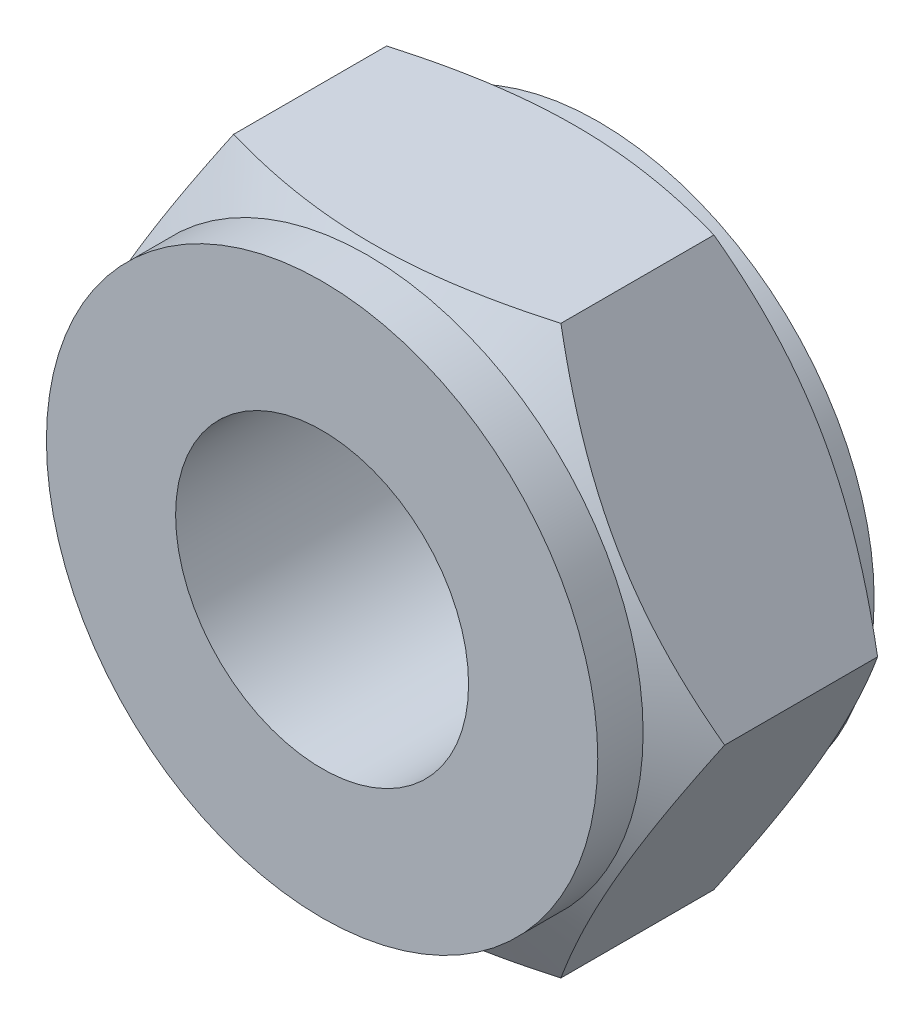
ISO-10303-21;
HEADER;
FILE_DESCRIPTION(('STEP AP214'),'2;1');
FILE_NAME('part.step','',(''),(''),'','','');
FILE_SCHEMA(('AUTOMOTIVE_DESIGN { 1 0 10303 214 1 1 1 1 }'));
ENDSEC;
DATA;
#1=APPLICATION_CONTEXT('core data for automotive mechanical design processes');
#2=APPLICATION_PROTOCOL_DEFINITION('international standard','automotive_design',2000,#1);
#3=PRODUCT_CONTEXT('',#1,'mechanical');
#4=PRODUCT('Part','Part','',(#3));
#5=PRODUCT_RELATED_PRODUCT_CATEGORY('part','',(#4));
#6=PRODUCT_DEFINITION_FORMATION('','',#4);
#7=PRODUCT_DEFINITION_CONTEXT('part definition',#1,'design');
#8=PRODUCT_DEFINITION('design','',#6,#7);
#9=PRODUCT_DEFINITION_SHAPE('','',#8);
#10=(LENGTH_UNIT() NAMED_UNIT(*) SI_UNIT(.MILLI.,.METRE.));
#11=(NAMED_UNIT(*) PLANE_ANGLE_UNIT() SI_UNIT($,.RADIAN.));
#12=(NAMED_UNIT(*) SI_UNIT($,.STERADIAN.) SOLID_ANGLE_UNIT());
#13=UNCERTAINTY_MEASURE_WITH_UNIT(LENGTH_MEASURE(1.E-05),#10,'distance_accuracy_value','');
#14=(GEOMETRIC_REPRESENTATION_CONTEXT(3) GLOBAL_UNCERTAINTY_ASSIGNED_CONTEXT((#13)) GLOBAL_UNIT_ASSIGNED_CONTEXT((#10,
#11,#12)) REPRESENTATION_CONTEXT('',''));
#15=CARTESIAN_POINT('',(0.,0.,0.));
#16=DIRECTION('',(0.,0.,1.));
#17=DIRECTION('',(1.,0.,0.));
#18=AXIS2_PLACEMENT_3D('',#15,#16,#17);
#19=CARTESIAN_POINT('',(0.,0.,3.28));
#20=DIRECTION('',(0.,0.,-1.));
#21=DIRECTION('',(-1.,0.,0.));
#22=AXIS2_PLACEMENT_3D('',#19,#20,#21);
#23=CYLINDRICAL_SURFACE('',#22,3.89);
#24=CARTESIAN_POINT('',(0.,0.,-3.52));
#25=DIRECTION('',(0.,0.,-1.));
#26=DIRECTION('',(-1.,0.,0.));
#27=AXIS2_PLACEMENT_3D('',#24,#25,#26);
#28=CIRCLE('',#27,3.89);
#29=CARTESIAN_POINT('',(-3.89,0.,-3.52));
#30=VERTEX_POINT('',#29);
#31=EDGE_CURVE('E20',#30,#30,#28,.T.);
#32=ORIENTED_EDGE('',*,*,#31,.F.);
#33=EDGE_LOOP('',(#32));
#34=FACE_BOUND('',#33,.T.);
#35=CARTESIAN_POINT('',(0.,0.,-3.26019237883202));
#36=DIRECTION('',(0.,0.,1.));
#37=DIRECTION('',(-1.,0.,0.));
#38=AXIS2_PLACEMENT_3D('',#35,#36,#37);
#39=CIRCLE('',#38,3.89000000006945);
#40=CARTESIAN_POINT('',(-3.89000000006945,0.,-3.26019237883202));
#41=VERTEX_POINT('',#40);
#42=EDGE_CURVE('E189',#41,#41,#39,.T.);
#43=ORIENTED_EDGE('',*,*,#42,.F.);
#44=EDGE_LOOP('',(#43));
#45=FACE_BOUND('',#44,.T.);
#46=ADVANCED_FACE('F17',(#34,#45),#23,.T.);
#47=CARTESIAN_POINT('',(0.,0.,-2.83689361464212));
#48=DIRECTION('',(0.,0.,1.));
#49=DIRECTION('',(1.,0.,0.));
#50=AXIS2_PLACEMENT_3D('',#47,#48,#49);
#51=CONICAL_SURFACE('',#50,4.62317496641163,1.04719755119624);
#52=CARTESIAN_POINT('',(-4.61880215351368,-5.73590683433179E-12,-2.83941825934587));
#53=CARTESIAN_POINT('',(-4.51731796242767,-0.175775775131739,-2.89802716909246));
#54=CARTESIAN_POINT('',(-4.41495776124794,-0.353068844247999,-2.95132890514521));
#55=CARTESIAN_POINT('',(-4.20846506047572,-0.710724693377609,-3.04436548454486));
#56=CARTESIAN_POINT('',(-4.10432889310188,-0.891093826174593,-3.08406741866906));
#57=CARTESIAN_POINT('',(-3.89734706567413,-1.24959686752292,-3.14586634145278));
#58=CARTESIAN_POINT('',(-3.79453324350631,-1.42767563123793,-3.16837468415098));
#59=CARTESIAN_POINT('',(-3.5884220785619,-1.78467064092886,-3.19523992308358));
#60=CARTESIAN_POINT('',(-3.4851254844293,-1.96358559021534,-3.1996190713959));
#61=CARTESIAN_POINT('',(-3.29212687968423,-2.29786897942371,-3.19048567903444));
#62=CARTESIAN_POINT('',(-3.2023959080588,-2.45328758129148,-3.1792156889114));
#63=CARTESIAN_POINT('',(-3.02351853281839,-2.76311228353242,-3.14350365790747));
#64=CARTESIAN_POINT('',(-2.93437274743071,-2.91751731310451,-3.11904942980642));
#65=CARTESIAN_POINT('',(-2.75512686792788,-3.22798028345079,-3.05791859266708));
#66=CARTESIAN_POINT('',(-2.66504944835346,-3.38399895076839,-3.02098297490716));
#67=CARTESIAN_POINT('',(-2.48623772534369,-3.69370994001023,-2.93715473766519));
#68=CARTESIAN_POINT('',(-2.39750113289062,-3.84740622662948,-2.89028180183956));
#69=CARTESIAN_POINT('',(-2.30940107675872,-3.99999999999961,-2.83941825934408));
#70=B_SPLINE_CURVE_WITH_KNOTS('',3,(#52,#53,#54,#55,#56,#57,#58,#59,#60,#61,#62,#63,#64,#65,#66,
#67,#68,#69),.UNSPECIFIED.,.F.,.F.,(4,2,2,2,2,2,2,2,4),(0.,0.634032023113349,1.26958763405349,
1.88941521230476,2.5084817777942,3.04741556526093,3.58684838758453,4.13824324497157,
4.68855594702268),.UNSPECIFIED.);
#71=CARTESIAN_POINT('',(-4.6188021534735,0.,-2.83941825937969));
#72=VERTEX_POINT('',#71);
#73=CARTESIAN_POINT('',(-2.30940107675838,-3.99999999999981,-2.83941825934408));
#74=VERTEX_POINT('',#73);
#75=EDGE_CURVE('E63',#72,#74,#70,.T.);
#76=ORIENTED_EDGE('',*,*,#75,.F.);
#77=CARTESIAN_POINT('',(-2.30940107675872,3.99999999999961,-2.83941825934408));
#78=CARTESIAN_POINT('',(-2.41088526784479,3.82422422487352,-2.89802716909082));
#79=CARTESIAN_POINT('',(-2.51324546902457,3.64693115575717,-2.95132890514373));
#80=CARTESIAN_POINT('',(-2.7197381697969,3.28927530662738,-3.0443654845437));
#81=CARTESIAN_POINT('',(-2.82387433717079,3.1089061738303,-3.08406741866806));
#82=CARTESIAN_POINT('',(-3.03085616459866,2.75040313248178,-3.14586634145211));
#83=CARTESIAN_POINT('',(-3.13366998676653,2.57232436876667,-3.16837468415047));
#84=CARTESIAN_POINT('',(-3.33978115171107,2.21532935907552,-3.19523992308339));
#85=CARTESIAN_POINT('',(-3.44307774584373,2.03641440978893,-3.19961907139588));
#86=CARTESIAN_POINT('',(-3.6360763505888,1.70213102058056,-3.19048567903468));
#87=CARTESIAN_POINT('',(-3.72580732221417,1.5467124187129,-3.17921568891178));
#88=CARTESIAN_POINT('',(-3.90468469745445,1.23688771647217,-3.14350365790813));
#89=CARTESIAN_POINT('',(-3.99383048284208,1.08248268690018,-3.11904942980722));
#90=CARTESIAN_POINT('',(-4.1730763623448,0.772019716554091,-3.05791859266816));
#91=CARTESIAN_POINT('',(-4.26315378191916,0.616001049236596,-3.02098297490839));
#92=CARTESIAN_POINT('',(-4.44196550492881,0.306290059994944,-2.9371547376667));
#93=CARTESIAN_POINT('',(-4.53070209738183,0.152593773375783,-2.89028180184121));
#94=CARTESIAN_POINT('',(-4.61880215351369,5.74348867595268E-12,-2.83941825934587));
#95=B_SPLINE_CURVE_WITH_KNOTS('',3,(#77,#78,#79,#80,#81,#82,#83,#84,#85,#86,#87,#88,#89,#90,#91,
#92,#93,#94),.UNSPECIFIED.,.F.,.F.,(4,2,2,2,2,2,2,2,4),(0.,0.63403202311376,1.26958763405432,
1.88941521230599,2.50848177779582,3.04741556526215,3.58684838758535,4.13824324497197,
4.68855594702266),.UNSPECIFIED.);
#96=CARTESIAN_POINT('',(-2.30940107675839,3.99999999999981,-2.83941825934408));
#97=VERTEX_POINT('',#96);
#98=EDGE_CURVE('E68',#97,#72,#95,.T.);
#99=ORIENTED_EDGE('',*,*,#98,.F.);
#100=CARTESIAN_POINT('',(2.30940107675805,4.,-2.83941825934408));
#101=CARTESIAN_POINT('',(2.10643269458592,4.,-2.89802716909082));
#102=CARTESIAN_POINT('',(1.90171229222636,4.,-2.95132890514373));
#103=CARTESIAN_POINT('',(1.48872689068169,4.,-3.0443654845437));
#104=CARTESIAN_POINT('',(1.2804545559339,4.,-3.08406741866807));
#105=CARTESIAN_POINT('',(0.866490901078168,4.,-3.14586634145211));
#106=CARTESIAN_POINT('',(0.660863256742426,4.,-3.16837468415047));
#107=CARTESIAN_POINT('',(0.248640926853356,4.,-3.19523992308339));
#108=CARTESIAN_POINT('',(0.0420477385880334,4.,-3.19961907139587));
#109=CARTESIAN_POINT('',(-0.343949470902628,4.,-3.19048567903466));
#110=CARTESIAN_POINT('',(-0.523411414153886,4.,-3.17921568891171));
#111=CARTESIAN_POINT('',(-0.881166164635488,4.,-3.14350365790788));
#112=CARTESIAN_POINT('',(-1.05945773541124,4.,-3.11904942980684));
#113=CARTESIAN_POINT('',(-1.41794949441772,4.,-3.05791859266747));
#114=CARTESIAN_POINT('',(-1.59810433356697,4.,-3.02098297490751));
#115=CARTESIAN_POINT('',(-1.95572777958731,4.,-2.93715473766539));
#116=CARTESIAN_POINT('',(-2.13320096449385,4.,-2.89028180183967));
#117=CARTESIAN_POINT('',(-2.30940107675805,4.,-2.83941825934408));
#118=B_SPLINE_CURVE_WITH_KNOTS('',3,(#100,#101,#102,#103,#104,#105,#106,#107,#108,#109,#110,
#111,#112,#113,#114,#115,#116,#117),.UNSPECIFIED.,.F.,.F.,(4,2,2,2,2,2,2,2,4),(0.,
0.634032023113766,1.26958763405433,1.88941521230599,2.50848177779582,3.04741556526371,
3.58684838758848,4.13824324497675,4.68855594702908),.UNSPECIFIED.);
#119=CARTESIAN_POINT('',(2.30940107675839,3.99999999999981,-2.83941825934408));
#120=VERTEX_POINT('',#119);
#121=EDGE_CURVE('E80',#120,#97,#118,.T.);
#122=ORIENTED_EDGE('',*,*,#121,.F.);
#123=CARTESIAN_POINT('',(4.61880215351369,5.73604323312061E-12,-2.83941825934586));
#124=CARTESIAN_POINT('',(4.51731796242768,0.17577577513174,-2.89802716909245));
#125=CARTESIAN_POINT('',(4.41495776124795,0.353068844248001,-2.95132890514521));
#126=CARTESIAN_POINT('',(4.20846506047573,0.710724693377611,-3.04436548454486));
#127=CARTESIAN_POINT('',(4.10432889310189,0.891093826174595,-3.08406741866906));
#128=CARTESIAN_POINT('',(3.89734706567413,1.24959686752292,-3.14586634145277));
#129=CARTESIAN_POINT('',(3.79453324350632,1.42767563123793,-3.16837468415097));
#130=CARTESIAN_POINT('',(3.5884220785619,1.78467064092887,-3.19523992308357));
#131=CARTESIAN_POINT('',(3.4851254844293,1.96358559021535,-3.1996190713959));
#132=CARTESIAN_POINT('',(3.29212687968424,2.29786897942371,-3.19048567903443));
#133=CARTESIAN_POINT('',(3.2023959080588,2.45328758129148,-3.1792156889114));
#134=CARTESIAN_POINT('',(3.0235185328184,2.76311228353242,-3.14350365790747));
#135=CARTESIAN_POINT('',(2.93437274743072,2.91751731310451,-3.11904942980641));
#136=CARTESIAN_POINT('',(2.75512686792788,3.2279802834508,-3.05791859266707));
#137=CARTESIAN_POINT('',(2.66504944835347,3.38399895076839,-3.02098297490715));
#138=CARTESIAN_POINT('',(2.4862377253437,3.69370994001023,-2.93715473766518));
#139=CARTESIAN_POINT('',(2.39750113289063,3.84740622662948,-2.89028180183956));
#140=CARTESIAN_POINT('',(2.30940107675873,3.99999999999961,-2.83941825934408));
#141=B_SPLINE_CURVE_WITH_KNOTS('',3,(#123,#124,#125,#126,#127,#128,#129,#130,#131,#132,#133,
#134,#135,#136,#137,#138,#139,#140),.UNSPECIFIED.,.F.,.F.,(4,2,2,2,2,2,2,2,4),(0.,
0.63403202311335,1.26958763405349,1.88941521230476,2.50848177779421,3.04741556526093,
3.58684838758453,4.13824324497157,4.68855594702267),.UNSPECIFIED.);
#142=CARTESIAN_POINT('',(4.61880215348771,0.,-2.83941825935585));
#143=VERTEX_POINT('',#142);
#144=EDGE_CURVE('E198',#143,#120,#141,.T.);
#145=ORIENTED_EDGE('',*,*,#144,.F.);
#146=CARTESIAN_POINT('',(2.30940107675874,-3.99999999999961,-2.83941825934408));
#147=CARTESIAN_POINT('',(2.4108852678448,-3.82422422487352,-2.89802716909081));
#148=CARTESIAN_POINT('',(2.51324546902458,-3.64693115575717,-2.95132890514372));
#149=CARTESIAN_POINT('',(2.71973816979691,-3.28927530662738,-3.04436548454369));
#150=CARTESIAN_POINT('',(2.82387433717081,-3.1089061738303,-3.08406741866806));
#151=CARTESIAN_POINT('',(3.03085616459868,-2.75040313248177,-3.1458663414521));
#152=CARTESIAN_POINT('',(3.13366998676655,-2.57232436876667,-3.16837468415047));
#153=CARTESIAN_POINT('',(3.33978115171109,-2.21532935907552,-3.19523992308339));
#154=CARTESIAN_POINT('',(3.44307774584375,-2.03641440978893,-3.19961907139587));
#155=CARTESIAN_POINT('',(3.63607635058882,-1.70213102058056,-3.19048567903467));
#156=CARTESIAN_POINT('',(3.72580732221419,-1.5467124187129,-3.17921568891177));
#157=CARTESIAN_POINT('',(3.90468469745447,-1.23688771647216,-3.14350365790812));
#158=CARTESIAN_POINT('',(3.99383048284209,-1.08248268690017,-3.11904942980721));
#159=CARTESIAN_POINT('',(4.17307636234482,-0.772019716554091,-3.05791859266815));
#160=CARTESIAN_POINT('',(4.26315378191918,-0.616001049236597,-3.02098297490838));
#161=CARTESIAN_POINT('',(4.44196550492883,-0.306290059994946,-2.93715473766669));
#162=CARTESIAN_POINT('',(4.53070209738185,-0.152593773375787,-2.8902818018412));
#163=CARTESIAN_POINT('',(4.6188021535137,-5.74804397884381E-12,-2.83941825934586));
#164=B_SPLINE_CURVE_WITH_KNOTS('',3,(#146,#147,#148,#149,#150,#151,#152,#153,#154,#155,#156,
#157,#158,#159,#160,#161,#162,#163),.UNSPECIFIED.,.F.,.F.,(4,2,2,2,2,2,2,2,4),(0.,
0.634032023113761,1.26958763405432,1.88941521230599,2.50848177779583,3.04741556526215,
3.58684838758535,4.13824324497196,4.68855594702265),.UNSPECIFIED.);
#165=CARTESIAN_POINT('',(2.3094010767584,-3.9999999999998,-2.83941825934408));
#166=VERTEX_POINT('',#165);
#167=EDGE_CURVE('E113',#166,#143,#164,.T.);
#168=ORIENTED_EDGE('',*,*,#167,.F.);
#169=CARTESIAN_POINT('',(-2.30940107675804,-4.,-2.83941825934408));
#170=CARTESIAN_POINT('',(-2.10643269458591,-4.,-2.89802716909082));
#171=CARTESIAN_POINT('',(-1.90171229222635,-4.,-2.95132890514373));
#172=CARTESIAN_POINT('',(-1.48872689068169,-4.,-3.0443654845437));
#173=CARTESIAN_POINT('',(-1.2804545559339,-4.,-3.08406741866807));
#174=CARTESIAN_POINT('',(-0.866490901078162,-4.,-3.14586634145211));
#175=CARTESIAN_POINT('',(-0.66086325674242,-4.,-3.16837468415047));
#176=CARTESIAN_POINT('',(-0.24864092685335,-4.,-3.19523992308339));
#177=CARTESIAN_POINT('',(-0.0420477385880274,-4.,-3.19961907139588));
#178=CARTESIAN_POINT('',(0.343949470902635,-4.,-3.19048567903466));
#179=CARTESIAN_POINT('',(0.523411414153894,-4.,-3.17921568891171));
#180=CARTESIAN_POINT('',(0.881166164635497,-4.,-3.14350365790788));
#181=CARTESIAN_POINT('',(1.05945773541125,-4.,-3.11904942980684));
#182=CARTESIAN_POINT('',(1.41794949441773,-4.,-3.05791859266747));
#183=CARTESIAN_POINT('',(1.59810433356698,-4.,-3.02098297490751));
#184=CARTESIAN_POINT('',(1.95572777958732,-4.,-2.93715473766539));
#185=CARTESIAN_POINT('',(2.13320096449386,-4.,-2.89028180183967));
#186=CARTESIAN_POINT('',(2.30940107675806,-4.,-2.83941825934408));
#187=B_SPLINE_CURVE_WITH_KNOTS('',3,(#169,#170,#171,#172,#173,#174,#175,#176,#177,#178,#179,
#180,#181,#182,#183,#184,#185,#186),.UNSPECIFIED.,.F.,.F.,(4,2,2,2,2,2,2,2,4),(0.,
0.634032023113765,1.26958763405433,1.88941521230599,2.50848177779582,3.04741556526371,
3.58684838758848,4.13824324497675,4.68855594702909),.UNSPECIFIED.);
#188=EDGE_CURVE('E71',#74,#166,#187,.T.);
#189=ORIENTED_EDGE('',*,*,#188,.F.);
#190=EDGE_LOOP('',(#76,#99,#122,#145,#168,#189));
#191=FACE_BOUND('',#190,.T.);
#192=ORIENTED_EDGE('',*,*,#42,.T.);
#193=EDGE_LOOP('',(#192));
#194=FACE_BOUND('',#193,.T.);
#195=ADVANCED_FACE('F64',(#191,#194),#51,.T.);
#196=CARTESIAN_POINT('',(-2.30940107675849,-4.,-3.52));
#197=DIRECTION('',(0.,0.,-1.));
#198=DIRECTION('',(-1.,0.,0.));
#199=AXIS2_PLACEMENT_3D('',#196,#197,#198);
#200=PLANE('',#199);
#201=CARTESIAN_POINT('',(0.,0.,-3.52000000004606));
#202=DIRECTION('',(0.,0.,-1.));
#203=DIRECTION('',(-1.,0.,0.));
#204=AXIS2_PLACEMENT_3D('',#201,#202,#203);
#205=CIRCLE('',#204,2.87500000001728);
#206=CARTESIAN_POINT('',(-2.87500000001728,0.,-3.52000000004606));
#207=VERTEX_POINT('',#206);
#208=EDGE_CURVE('E83',#207,#207,#205,.F.);
#209=ORIENTED_EDGE('',*,*,#208,.T.);
#210=EDGE_LOOP('',(#209));
#211=FACE_BOUND('',#210,.T.);
#212=ORIENTED_EDGE('',*,*,#31,.T.);
#213=EDGE_LOOP('',(#212));
#214=FACE_BOUND('',#213,.T.);
#215=ADVANCED_FACE('F106',(#211,#214),#200,.T.);
#216=CARTESIAN_POINT('',(-4.618802153517,0.,-3.52));
#217=DIRECTION('',(-0.866025403784439,-0.5,0.));
#218=DIRECTION('',(0.5,-0.866025403784439,0.));
#219=AXIS2_PLACEMENT_3D('',#216,#217,#218);
#220=PLANE('',#219);
#221=DIRECTION('',(0.,0.,1.));
#222=VECTOR('',#221,1.);
#223=CARTESIAN_POINT('',(-4.618802153517,0.,-3.52));
#224=LINE('',#223,#222);
#225=CARTESIAN_POINT('',(-4.61880215351613,0.,-0.680581740657889));
#226=VERTEX_POINT('',#225);
#227=EDGE_CURVE('E74',#72,#226,#224,.T.);
#228=ORIENTED_EDGE('',*,*,#227,.F.);
#229=ORIENTED_EDGE('',*,*,#75,.T.);
#230=DIRECTION('',(0.,0.,1.));
#231=VECTOR('',#230,1.);
#232=CARTESIAN_POINT('',(-2.30940107675849,-4.,-3.52));
#233=LINE('',#232,#231);
#234=CARTESIAN_POINT('',(-2.30940109340961,-4.,-0.680581745467265));
#235=VERTEX_POINT('',#234);
#236=EDGE_CURVE('E73',#235,#74,#233,.F.);
#237=ORIENTED_EDGE('',*,*,#236,.F.);
#238=CARTESIAN_POINT('',(-4.61880215351596,-1.80305391824773E-12,-0.680581740659897));
#239=CARTESIAN_POINT('',(-4.51731796244398,-0.175775775103493,-0.621972830921223));
#240=CARTESIAN_POINT('',(-4.41495776127846,-0.353068844195138,-0.568671094875031));
#241=CARTESIAN_POINT('',(-4.20846506053689,-0.710724693271661,-0.475634515485113));
#242=CARTESIAN_POINT('',(-4.10432889317952,-0.891093826040126,-0.435932581363831));
#243=CARTESIAN_POINT('',(-3.89734706575416,-1.24959686738429,-0.374133658570449));
#244=CARTESIAN_POINT('',(-3.7945332435719,-1.42767563112431,-0.351625315864611));
#245=CARTESIAN_POINT('',(-3.58842207859598,-1.78467064086982,-0.324760076922744));
#246=CARTESIAN_POINT('',(-3.48512548444632,-1.96358559018586,-0.320380928609024));
#247=CARTESIAN_POINT('',(-3.29212688334392,-2.29786897308494,-0.329514320795707));
#248=CARTESIAN_POINT('',(-3.20239591537037,-2.45328756862745,-0.340784310171359));
#249=CARTESIAN_POINT('',(-3.02351854737306,-2.763112258323,-0.376496338652439));
#250=CARTESIAN_POINT('',(-2.93437276557644,-2.9175172816752,-0.400950564975588));
#251=CARTESIAN_POINT('',(-2.75512689333883,-3.22798023943772,-0.462081397681879));
#252=CARTESIAN_POINT('',(-2.66504947743503,-3.38399890039763,-0.49901701275454));
#253=CARTESIAN_POINT('',(-2.48623776163293,-3.69370987715542,-0.582845244037596));
#254=CARTESIAN_POINT('',(-2.3975011727174,-3.84740615764747,-0.629718176595119));
#255=CARTESIAN_POINT('',(-2.30940112007343,-3.99999992497632,-0.680581715652609));
#256=B_SPLINE_CURVE_WITH_KNOTS('',3,(#238,#239,#240,#241,#242,#243,#244,#245,#246,#247,#248,
#249,#250,#251,#252,#253,#254,#255),.UNSPECIFIED.,.F.,.F.,(4,2,2,2,2,2,2,2,4),(0.,
0.634032023026007,1.26958763386756,1.88941521220828,2.50848177779535,3.04741554331967,
3.58684834361968,4.13824317783946,4.68855585689971),.UNSPECIFIED.);
#257=EDGE_CURVE('E35',#226,#235,#256,.T.);
#258=ORIENTED_EDGE('',*,*,#257,.F.);
#259=EDGE_LOOP('',(#228,#229,#237,#258));
#260=FACE_BOUND('',#259,.T.);
#261=ADVANCED_FACE('F75',(#260),#220,.T.);
#262=CARTESIAN_POINT('',(-2.30940107675849,-4.,-3.52));
#263=DIRECTION('',(0.,-1.,0.));
#264=DIRECTION('',(1.,0.,0.));
#265=AXIS2_PLACEMENT_3D('',#262,#263,#264);
#266=PLANE('',#265);
#267=ORIENTED_EDGE('',*,*,#236,.T.);
#268=ORIENTED_EDGE('',*,*,#188,.T.);
#269=DIRECTION('',(0.,0.,1.));
#270=VECTOR('',#269,1.);
#271=CARTESIAN_POINT('',(2.30940107675852,-4.,-3.52));
#272=LINE('',#271,#270);
#273=CARTESIAN_POINT('',(2.30940106843087,-4.00000001442391,-0.680581745468477));
#274=VERTEX_POINT('',#273);
#275=EDGE_CURVE('E130',#274,#166,#272,.F.);
#276=ORIENTED_EDGE('',*,*,#275,.F.);
#277=CARTESIAN_POINT('',(-2.30940110351642,-3.99999996248763,-0.680581772944216));
#278=CARTESIAN_POINT('',(-2.10643272249927,-3.99999998652724,-0.621972847174614));
#279=CARTESIAN_POINT('',(-1.90171231902133,-3.99999999638907,-0.568671103799689));
#280=CARTESIAN_POINT('',(-1.48872691340506,-4.0000000036196,-0.475634517672028));
#281=CARTESIAN_POINT('',(-1.28045457570248,-4.00000000095822,-0.43593258414569));
#282=CARTESIAN_POINT('',(-0.866490915803741,-3.99999999906549,-0.374133660889823));
#283=CARTESIAN_POINT('',(-0.660863269373307,-3.99999999975089,-0.351625317135899));
#284=CARTESIAN_POINT('',(-0.248640935005505,-4.0000000002488,-0.324760076994751));
#285=CARTESIAN_POINT('',(-0.042047744355798,-4.00000000006239,-0.320380928537159));
#286=CARTESIAN_POINT('',(0.343949460368308,-3.99999999994568,-0.329514320663676));
#287=CARTESIAN_POINT('',(0.523411396493218,-3.99999999998536,-0.340784309946792));
#288=CARTESIAN_POINT('',(0.881166132795949,-4.00000000001465,-0.376496338300437));
#289=CARTESIAN_POINT('',(1.05945769651991,-4.00000000000422,-0.400950564584484));
#290=CARTESIAN_POINT('',(1.41794944151398,-3.99999999999568,-0.462081397272556));
#291=CARTESIAN_POINT('',(1.59810427370667,-3.99999999999784,-0.499017012383614));
#292=CARTESIAN_POINT('',(1.95572770615214,-4.00000000000215,-0.582845243809378));
#293=CARTESIAN_POINT('',(2.13320088443837,-4.0000000000043,-0.629718176475666));
#294=CARTESIAN_POINT('',(2.30940099017536,-4.,-0.680581715666101));
#295=B_SPLINE_CURVE_WITH_KNOTS('',3,(#277,#278,#279,#280,#281,#282,#283,#284,#285,#286,#287,
#288,#289,#290,#291,#292,#293,#294),.UNSPECIFIED.,.F.,.F.,(4,2,2,2,2,2,2,2,4),(0.,
0.634032031834983,1.26958765081319,1.88941523582196,2.50848180835725,3.0474155744189,
3.58684837508235,4.13824321045645,4.68855589091895),.UNSPECIFIED.);
#296=EDGE_CURVE('E141',#235,#274,#295,.T.);
#297=ORIENTED_EDGE('',*,*,#296,.F.);
#298=EDGE_LOOP('',(#267,#268,#276,#297));
#299=FACE_BOUND('',#298,.T.);
#300=ADVANCED_FACE('F131',(#299),#266,.T.);
#301=CARTESIAN_POINT('',(2.30940107675852,-4.,-3.52));
#302=DIRECTION('',(0.866025403784439,-0.5,0.));
#303=DIRECTION('',(0.5,0.866025403784439,0.));
#304=AXIS2_PLACEMENT_3D('',#301,#302,#303);
#305=PLANE('',#304);
#306=ORIENTED_EDGE('',*,*,#275,.T.);
#307=ORIENTED_EDGE('',*,*,#167,.T.);
#308=DIRECTION('',(0.,0.,1.));
#309=VECTOR('',#308,1.);
#310=CARTESIAN_POINT('',(4.61880215351701,0.,-3.52));
#311=LINE('',#310,#309);
#312=CARTESIAN_POINT('',(4.61880215351597,0.,-0.680581740659905));
#313=VERTEX_POINT('',#312);
#314=EDGE_CURVE('E195',#313,#143,#311,.F.);
#315=ORIENTED_EDGE('',*,*,#314,.F.);
#316=CARTESIAN_POINT('',(2.30940103090809,-4.00000000444028,-0.680581772931595));
#317=CARTESIAN_POINT('',(2.41088524223646,-3.82422424230081,-0.621972847163885));
#318=CARTESIAN_POINT('',(2.51324545252448,-3.64693117711912,-0.568671103786385));
#319=CARTESIAN_POINT('',(2.71973816162016,-3.28927532802434,-0.475634517651644));
#320=CARTESIAN_POINT('',(2.82387432818394,-3.10890619131118,-0.435932584121048));
#321=CARTESIAN_POINT('',(3.03085615649661,-2.75040314464718,-0.374133660873277));
#322=CARTESIAN_POINT('',(3.1336699802902,-2.57232437948613,-0.35162531712675));
#323=CARTESIAN_POINT('',(3.33978114787275,-2.21532936622099,-0.324760076993857));
#324=CARTESIAN_POINT('',(3.44307774301879,-2.0364144148066,-0.320380928536883));
#325=CARTESIAN_POINT('',(3.63607634892112,-1.70213102336053,-0.329514320836684));
#326=CARTESIAN_POINT('',(3.72580732066883,-1.54671242136028,-0.340784310866357));
#327=CARTESIAN_POINT('',(3.90468469608674,-1.23688771887043,-0.376496341740967));
#328=CARTESIAN_POINT('',(3.99383048152983,-1.08248268918152,-0.400950569801861));
#329=CARTESIAN_POINT('',(4.17307636128278,-0.772019718384964,-0.462081406920684));
#330=CARTESIAN_POINT('',(4.2631537810506,-0.616001050736709,-0.499017024717738));
#331=CARTESIAN_POINT('',(4.44196550448273,-0.306290060771917,-0.582845262099807));
#332=CARTESIAN_POINT('',(4.53070209716425,-0.152593773761278,-0.629718198032846));
#333=CARTESIAN_POINT('',(4.61880215351597,-1.81536132999244E-12,-0.680581740659906));
#334=B_SPLINE_CURVE_WITH_KNOTS('',3,(#316,#317,#318,#319,#320,#321,#322,#323,#324,#325,#326,
#327,#328,#329,#330,#331,#332,#333),.UNSPECIFIED.,.F.,.F.,(4,2,2,2,2,2,2,2,4),(0.,
0.634032031918795,1.26958765099256,1.88941523590971,2.508481808345,3.04741559634307,
3.58684841902422,4.13824327755889,4.68855598100544),.UNSPECIFIED.);
#335=EDGE_CURVE('E149',#274,#313,#334,.T.);
#336=ORIENTED_EDGE('',*,*,#335,.F.);
#337=EDGE_LOOP('',(#306,#307,#315,#336));
#338=FACE_BOUND('',#337,.T.);
#339=ADVANCED_FACE('F134',(#338),#305,.T.);
#340=CARTESIAN_POINT('',(4.61880215351701,0.,-3.52));
#341=DIRECTION('',(0.866025403784439,0.5,0.));
#342=DIRECTION('',(-0.5,0.866025403784439,0.));
#343=AXIS2_PLACEMENT_3D('',#340,#341,#342);
#344=PLANE('',#343);
#345=ORIENTED_EDGE('',*,*,#314,.T.);
#346=ORIENTED_EDGE('',*,*,#144,.T.);
#347=DIRECTION('',(0.,0.,1.));
#348=VECTOR('',#347,1.);
#349=CARTESIAN_POINT('',(2.3094010767585,4.,-3.52));
#350=LINE('',#349,#348);
#351=CARTESIAN_POINT('',(2.30940109340859,4.,-0.680581745466972));
#352=VERTEX_POINT('',#351);
#353=EDGE_CURVE('E199',#352,#120,#350,.F.);
#354=ORIENTED_EDGE('',*,*,#353,.F.);
#355=CARTESIAN_POINT('',(4.61880215351596,1.80430192027607E-12,-0.680581740659903));
#356=CARTESIAN_POINT('',(4.51731796244399,0.175775775103495,-0.621972830921228));
#357=CARTESIAN_POINT('',(4.41495776127847,0.353068844195141,-0.568671094875036));
#358=CARTESIAN_POINT('',(4.20846506053689,0.710724693271667,-0.475634515485118));
#359=CARTESIAN_POINT('',(4.10432889317952,0.891093826040132,-0.435932581363836));
#360=CARTESIAN_POINT('',(3.89734706575417,1.24959686738429,-0.374133658570454));
#361=CARTESIAN_POINT('',(3.79453324357191,1.42767563112432,-0.351625315864617));
#362=CARTESIAN_POINT('',(3.58842207859599,1.78467064086982,-0.324760076922749));
#363=CARTESIAN_POINT('',(3.48512548444633,1.96358559018586,-0.320380928609029));
#364=CARTESIAN_POINT('',(3.29212688334384,2.29786897308508,-0.329514320795716));
#365=CARTESIAN_POINT('',(3.20239591537022,2.45328756862774,-0.340784310171385));
#366=CARTESIAN_POINT('',(3.02351854737274,2.76311225832357,-0.376496338652522));
#367=CARTESIAN_POINT('',(2.93437276557603,2.91751728167591,-0.40095056497571));
#368=CARTESIAN_POINT('',(2.75512689333827,3.22798023943872,-0.4620813976821));
#369=CARTESIAN_POINT('',(2.66504947743438,3.38399890039877,-0.499017012754822));
#370=CARTESIAN_POINT('',(2.48623776163213,3.69370987715684,-0.582845244038013));
#371=CARTESIAN_POINT('',(2.39750117271652,3.84740615764903,-0.62971817659561));
#372=CARTESIAN_POINT('',(2.30940112007247,3.99999992497801,-0.680581715653176));
#373=B_SPLINE_CURVE_WITH_KNOTS('',3,(#355,#356,#357,#358,#359,#360,#361,#362,#363,#364,#365,
#366,#367,#368,#369,#370,#371,#372),.UNSPECIFIED.,.F.,.F.,(4,2,2,2,2,2,2,2,4),(0.,
0.63403202302601,1.26958763386756,1.88941521220829,2.50848177779535,3.04741554332016,
3.58684834362067,4.13824317784097,4.68855585690174),.UNSPECIFIED.);
#374=EDGE_CURVE('E420',#313,#352,#373,.T.);
#375=ORIENTED_EDGE('',*,*,#374,.F.);
#376=EDGE_LOOP('',(#345,#346,#354,#375));
#377=FACE_BOUND('',#376,.T.);
#378=ADVANCED_FACE('F268',(#377),#344,.T.);
#379=CARTESIAN_POINT('',(2.3094010767585,4.,-3.52));
#380=DIRECTION('',(0.,1.,0.));
#381=DIRECTION('',(-1.,0.,0.));
#382=AXIS2_PLACEMENT_3D('',#379,#380,#381);
#383=PLANE('',#382);
#384=ORIENTED_EDGE('',*,*,#353,.T.);
#385=ORIENTED_EDGE('',*,*,#121,.T.);
#386=DIRECTION('',(0.,0.,1.));
#387=VECTOR('',#386,1.);
#388=CARTESIAN_POINT('',(-2.3094010767585,4.,-3.52));
#389=LINE('',#388,#387);
#390=CARTESIAN_POINT('',(-2.30940106843097,4.0000000144237,-0.680581745468403));
#391=VERTEX_POINT('',#390);
#392=EDGE_CURVE('E79',#391,#97,#389,.F.);
#393=ORIENTED_EDGE('',*,*,#392,.F.);
#394=CARTESIAN_POINT('',(2.30940110351448,3.99999996248827,-0.680581772943237));
#395=CARTESIAN_POINT('',(2.10643272249734,3.99999998652747,-0.621972847173943));
#396=CARTESIAN_POINT('',(1.90171231901945,3.99999999638914,-0.568671103799182));
#397=CARTESIAN_POINT('',(1.4887269134033,4.00000000361954,-0.475634517671714));
#398=CARTESIAN_POINT('',(1.28045457570079,4.00000000095821,-0.435932584145406));
#399=CARTESIAN_POINT('',(0.866490915802194,3.99999999906551,-0.374133660889626));
#400=CARTESIAN_POINT('',(0.660863269371822,3.9999999997509,-0.351625317135759));
#401=CARTESIAN_POINT('',(0.248640935004154,4.0000000002488,-0.324760076994709));
#402=CARTESIAN_POINT('',(0.0420477443545168,4.00000000006239,-0.320380928537156));
#403=CARTESIAN_POINT('',(-0.34394946036946,3.99999999994569,-0.329514320663737));
#404=CARTESIAN_POINT('',(-0.523411396494312,3.99999999998536,-0.340784309946878));
#405=CARTESIAN_POINT('',(-0.881166132796926,4.00000000001466,-0.376496338300563));
#406=CARTESIAN_POINT('',(-1.05945769652083,4.00000000000423,-0.400950564584625));
#407=CARTESIAN_POINT('',(-1.41794944151477,3.99999999999568,-0.462081397272715));
#408=CARTESIAN_POINT('',(-1.5981042737074,3.99999999999785,-0.499017012383775));
#409=CARTESIAN_POINT('',(-1.95572770615274,4.00000000000216,-0.582845243809535));
#410=CARTESIAN_POINT('',(-2.1332008844389,4.00000000000431,-0.629718176475817));
#411=CARTESIAN_POINT('',(-2.30940099017583,4.,-0.680581715666241));
#412=B_SPLINE_CURVE_WITH_KNOTS('',3,(#394,#395,#396,#397,#398,#399,#400,#401,#402,#403,#404,
#405,#406,#407,#408,#409,#410,#411),.UNSPECIFIED.,.F.,.F.,(4,2,2,2,2,2,2,2,4),(0.,
0.634032031834733,1.2695876508127,1.88941523582127,2.50848180835634,3.04741557441782,
3.5868483750811,4.13824321045501,4.68855589091732),.UNSPECIFIED.);
#413=EDGE_CURVE('E170',#352,#391,#412,.T.);
#414=ORIENTED_EDGE('',*,*,#413,.F.);
#415=EDGE_LOOP('',(#384,#385,#393,#414));
#416=FACE_BOUND('',#415,.T.);
#417=ADVANCED_FACE('F229',(#416),#383,.T.);
#418=CARTESIAN_POINT('',(-2.3094010767585,4.,-3.52));
#419=DIRECTION('',(-0.866025403784439,0.5,0.));
#420=DIRECTION('',(-0.5,-0.866025403784439,0.));
#421=AXIS2_PLACEMENT_3D('',#418,#419,#420);
#422=PLANE('',#421);
#423=ORIENTED_EDGE('',*,*,#392,.T.);
#424=ORIENTED_EDGE('',*,*,#98,.T.);
#425=ORIENTED_EDGE('',*,*,#227,.T.);
#426=CARTESIAN_POINT('',(-2.30940103090844,4.00000000443996,-0.68058177293136));
#427=CARTESIAN_POINT('',(-2.41088524223672,3.82422424230045,-0.621972847163723));
#428=CARTESIAN_POINT('',(-2.5132454525247,3.64693117711875,-0.568671103786262));
#429=CARTESIAN_POINT('',(-2.71973816162034,3.28927532802397,-0.475634517651565));
#430=CARTESIAN_POINT('',(-2.82387432818412,3.10890619131083,-0.435932584120975));
#431=CARTESIAN_POINT('',(-3.03085615649678,2.75040314464687,-0.374133660873224));
#432=CARTESIAN_POINT('',(-3.13366998029036,2.57232437948584,-0.35162531712671));
#433=CARTESIAN_POINT('',(-3.33978114787289,2.21532936622072,-0.32476007699384));
#434=CARTESIAN_POINT('',(-3.44307774301892,2.03641441480634,-0.320380928536874));
#435=CARTESIAN_POINT('',(-3.63607634892124,1.70213102336031,-0.329514320836689));
#436=CARTESIAN_POINT('',(-3.72580732066893,1.54671242136008,-0.340784310866367));
#437=CARTESIAN_POINT('',(-3.90468469608682,1.23688771887027,-0.376496341740983));
#438=CARTESIAN_POINT('',(-3.9938304815299,1.08248268918137,-0.400950569801878));
#439=CARTESIAN_POINT('',(-4.17307636128282,0.772019718384856,-0.462081406920701));
#440=CARTESIAN_POINT('',(-4.26315378105063,0.616001050736621,-0.499017024717752));
#441=CARTESIAN_POINT('',(-4.44196550448274,0.306290060771869,-0.582845262099813));
#442=CARTESIAN_POINT('',(-4.53070209716425,0.152593773761249,-0.629718198032846));
#443=CARTESIAN_POINT('',(-4.61880215351596,1.80617967026798E-12,-0.6805817406599));
#444=B_SPLINE_CURVE_WITH_KNOTS('',3,(#426,#427,#428,#429,#430,#431,#432,#433,#434,#435,#436,
#437,#438,#439,#440,#441,#442,#443),.UNSPECIFIED.,.F.,.F.,(4,2,2,2,2,2,2,2,4),(0.,
0.634032031918734,1.26958765099245,1.88941523590954,2.50848180834478,3.04741559634279,
3.58684841902387,4.13824327755847,4.68855598100495),.UNSPECIFIED.);
#445=EDGE_CURVE('E179',#391,#226,#444,.T.);
#446=ORIENTED_EDGE('',*,*,#445,.F.);
#447=EDGE_LOOP('',(#423,#424,#425,#446));
#448=FACE_BOUND('',#447,.T.);
#449=ADVANCED_FACE('F82',(#448),#422,.T.);
#450=CARTESIAN_POINT('',(0.,0.,-3.51999999998043));
#451=DIRECTION('',(0.,0.,-1.));
#452=DIRECTION('',(-1.,0.,0.));
#453=AXIS2_PLACEMENT_3D('',#450,#451,#452);
#454=CONICAL_SURFACE('',#453,2.87499999990359,1.04719755119535);
#455=ORIENTED_EDGE('',*,*,#208,.F.);
#456=EDGE_LOOP('',(#455));
#457=FACE_BOUND('',#456,.T.);
#458=CARTESIAN_POINT('',(0.,0.,-3.05350098249479));
#459=DIRECTION('',(0.,0.,1.));
#460=DIRECTION('',(1.,0.,0.));
#461=AXIS2_PLACEMENT_3D('',#458,#459,#460);
#462=CIRCLE('',#461,2.067);
#463=CARTESIAN_POINT('',(2.067,0.,-3.05350098249479));
#464=VERTEX_POINT('',#463);
#465=EDGE_CURVE('E185',#464,#464,#462,.T.);
#466=ORIENTED_EDGE('',*,*,#465,.T.);
#467=EDGE_LOOP('',(#466));
#468=FACE_BOUND('',#467,.T.);
#469=ADVANCED_FACE('F164',(#457,#468),#454,.F.);
#470=CARTESIAN_POINT('',(0.,0.,-0.683106385395149));
#471=DIRECTION('',(0.,0.,-1.));
#472=DIRECTION('',(-1.,0.,0.));
#473=AXIS2_PLACEMENT_3D('',#470,#471,#472);
#474=CONICAL_SURFACE('',#473,4.62317496646847,1.04719755119624);
#475=ORIENTED_EDGE('',*,*,#335,.T.);
#476=ORIENTED_EDGE('',*,*,#374,.T.);
#477=ORIENTED_EDGE('',*,*,#413,.T.);
#478=ORIENTED_EDGE('',*,*,#445,.T.);
#479=ORIENTED_EDGE('',*,*,#257,.T.);
#480=ORIENTED_EDGE('',*,*,#296,.T.);
#481=EDGE_LOOP('',(#475,#476,#477,#478,#479,#480));
#482=FACE_BOUND('',#481,.T.);
#483=CARTESIAN_POINT('',(0.,0.,-0.259807621135334));
#484=DIRECTION('',(0.,0.,-1.));
#485=DIRECTION('',(-1.,0.,0.));
#486=AXIS2_PLACEMENT_3D('',#483,#484,#485);
#487=CIRCLE('',#486,3.89);
#488=CARTESIAN_POINT('',(-3.89,0.,-0.259807621135334));
#489=VERTEX_POINT('',#488);
#490=EDGE_CURVE('E187',#489,#489,#487,.F.);
#491=ORIENTED_EDGE('',*,*,#490,.F.);
#492=EDGE_LOOP('',(#491));
#493=FACE_BOUND('',#492,.T.);
#494=ADVANCED_FACE('F159',(#482,#493),#474,.T.);
#495=CARTESIAN_POINT('',(0.,0.,-3.52));
#496=DIRECTION('',(0.,0.,1.));
#497=DIRECTION('',(1.,0.,0.));
#498=AXIS2_PLACEMENT_3D('',#495,#496,#497);
#499=CYLINDRICAL_SURFACE('',#498,2.067);
#500=CARTESIAN_POINT('',(0.,0.,0.38));
#501=DIRECTION('',(0.,0.,1.));
#502=DIRECTION('',(1.,0.,0.));
#503=AXIS2_PLACEMENT_3D('',#500,#501,#502);
#504=CIRCLE('',#503,2.067);
#505=CARTESIAN_POINT('',(2.067,0.,0.38));
#506=VERTEX_POINT('',#505);
#507=EDGE_CURVE('E26',#506,#506,#504,.F.);
#508=ORIENTED_EDGE('',*,*,#507,.F.);
#509=EDGE_LOOP('',(#508));
#510=FACE_BOUND('',#509,.T.);
#511=ORIENTED_EDGE('',*,*,#465,.F.);
#512=EDGE_LOOP('',(#511));
#513=FACE_BOUND('',#512,.T.);
#514=ADVANCED_FACE('F163',(#510,#513),#499,.F.);
#515=CARTESIAN_POINT('',(0.,0.,3.28));
#516=DIRECTION('',(0.,0.,-1.));
#517=DIRECTION('',(-1.,0.,0.));
#518=AXIS2_PLACEMENT_3D('',#515,#516,#517);
#519=CYLINDRICAL_SURFACE('',#518,3.89);
#520=ORIENTED_EDGE('',*,*,#490,.T.);
#521=EDGE_LOOP('',(#520));
#522=FACE_BOUND('',#521,.T.);
#523=CARTESIAN_POINT('',(0.,0.,0.38));
#524=DIRECTION('',(0.,0.,-1.));
#525=DIRECTION('',(-1.,0.,0.));
#526=AXIS2_PLACEMENT_3D('',#523,#524,#525);
#527=CIRCLE('',#526,3.89);
#528=CARTESIAN_POINT('',(-3.89,0.,0.38));
#529=VERTEX_POINT('',#528);
#530=EDGE_CURVE('E11',#529,#529,#527,.F.);
#531=ORIENTED_EDGE('',*,*,#530,.F.);
#532=EDGE_LOOP('',(#531));
#533=FACE_BOUND('',#532,.T.);
#534=ADVANCED_FACE('F207',(#522,#533),#519,.T.);
#535=CARTESIAN_POINT('',(0.,0.,0.38));
#536=DIRECTION('',(0.,0.,1.));
#537=DIRECTION('',(1.,0.,0.));
#538=AXIS2_PLACEMENT_3D('',#535,#536,#537);
#539=PLANE('',#538);
#540=ORIENTED_EDGE('',*,*,#530,.T.);
#541=EDGE_LOOP('',(#540));
#542=FACE_BOUND('',#541,.T.);
#543=ORIENTED_EDGE('',*,*,#507,.T.);
#544=EDGE_LOOP('',(#543));
#545=FACE_BOUND('',#544,.T.);
#546=ADVANCED_FACE('F211',(#542,#545),#539,.T.);
#547=CLOSED_SHELL('',(#46,#195,#215,#261,#300,#339,#378,#417,#449,#469,#494,#514,#534,#546));
#548=MANIFOLD_SOLID_BREP('B1',#547);
#549=ADVANCED_BREP_SHAPE_REPRESENTATION('',(#18,#548),#14);
#550=SHAPE_DEFINITION_REPRESENTATION(#9,#549);
ENDSEC;
END-ISO-10303-21;
